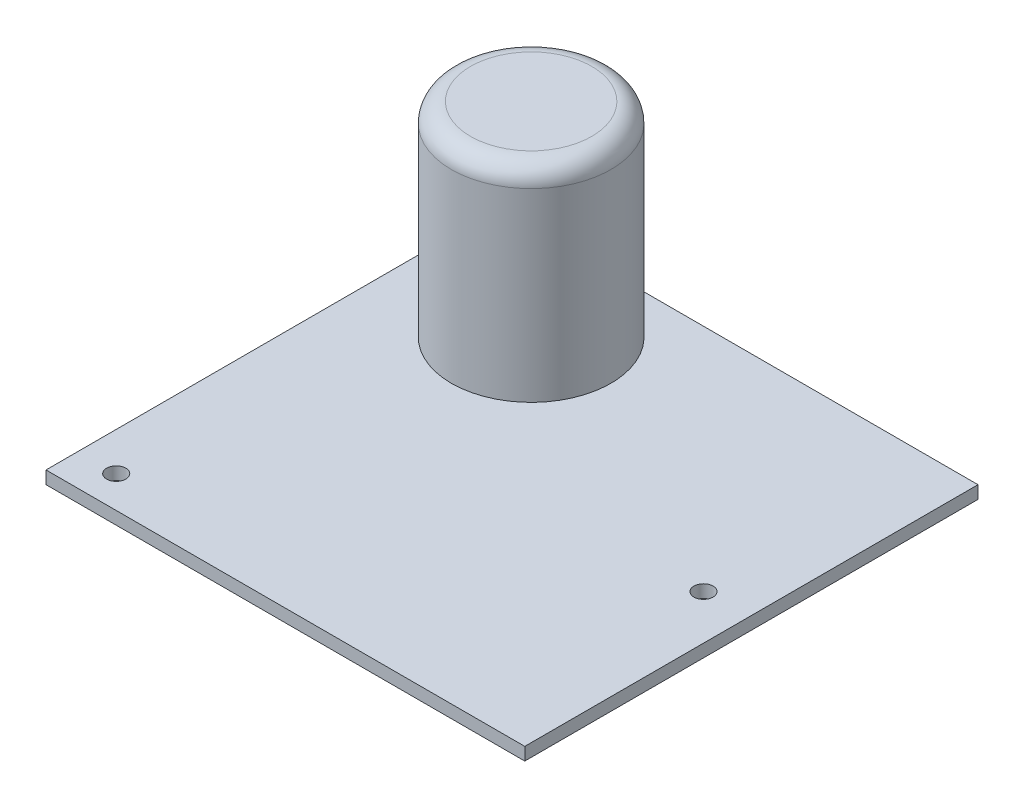
ISO-10303-21;
HEADER;
FILE_DESCRIPTION(('STEP AP214'),'2;1');
FILE_NAME('part.step','',(''),(''),'','','');
FILE_SCHEMA(('AUTOMOTIVE_DESIGN { 1 0 10303 214 1 1 1 1 }'));
ENDSEC;
DATA;
#1=APPLICATION_CONTEXT('core data for automotive mechanical design processes');
#2=APPLICATION_PROTOCOL_DEFINITION('international standard','automotive_design',2000,#1);
#3=PRODUCT_CONTEXT('',#1,'mechanical');
#4=PRODUCT('Part','Part','',(#3));
#5=PRODUCT_RELATED_PRODUCT_CATEGORY('part','',(#4));
#6=PRODUCT_DEFINITION_FORMATION('','',#4);
#7=PRODUCT_DEFINITION_CONTEXT('part definition',#1,'design');
#8=PRODUCT_DEFINITION('design','',#6,#7);
#9=PRODUCT_DEFINITION_SHAPE('','',#8);
#10=(LENGTH_UNIT() NAMED_UNIT(*) SI_UNIT(.MILLI.,.METRE.));
#11=(NAMED_UNIT(*) PLANE_ANGLE_UNIT() SI_UNIT($,.RADIAN.));
#12=(NAMED_UNIT(*) SI_UNIT($,.STERADIAN.) SOLID_ANGLE_UNIT());
#13=UNCERTAINTY_MEASURE_WITH_UNIT(LENGTH_MEASURE(1.E-05),#10,'distance_accuracy_value','');
#14=(GEOMETRIC_REPRESENTATION_CONTEXT(3) GLOBAL_UNCERTAINTY_ASSIGNED_CONTEXT((#13)) GLOBAL_UNIT_ASSIGNED_CONTEXT((#10,
#11,#12)) REPRESENTATION_CONTEXT('',''));
#15=CARTESIAN_POINT('',(0.,0.,0.));
#16=DIRECTION('',(0.,0.,1.));
#17=DIRECTION('',(1.,0.,0.));
#18=AXIS2_PLACEMENT_3D('',#15,#16,#17);
#19=CARTESIAN_POINT('',(0.,2.,0.));
#20=DIRECTION('',(0.,1.,0.));
#21=DIRECTION('',(0.,0.,1.));
#22=AXIS2_PLACEMENT_3D('',#19,#20,#21);
#23=PLANE('',#22);
#24=CARTESIAN_POINT('',(30.5,2.,0.999999999999987));
#25=DIRECTION('',(0.,1.,0.));
#26=DIRECTION('',(0.,0.,1.));
#27=AXIS2_PLACEMENT_3D('',#24,#25,#26);
#28=CIRCLE('',#27,1.5);
#29=CARTESIAN_POINT('',(30.5,2.,2.49999999999999));
#30=VERTEX_POINT('',#29);
#31=EDGE_CURVE('E159',#30,#30,#28,.T.);
#32=ORIENTED_EDGE('',*,*,#31,.F.);
#33=EDGE_LOOP('',(#32));
#34=FACE_BOUND('',#33,.T.);
#35=CARTESIAN_POINT('',(-31.5,2.,-30.));
#36=DIRECTION('',(0.,1.,0.));
#37=DIRECTION('',(0.,0.,1.));
#38=AXIS2_PLACEMENT_3D('',#35,#36,#37);
#39=CIRCLE('',#38,1.5);
#40=CARTESIAN_POINT('',(-31.5,2.,-28.5));
#41=VERTEX_POINT('',#40);
#42=EDGE_CURVE('E103',#41,#41,#39,.T.);
#43=ORIENTED_EDGE('',*,*,#42,.F.);
#44=EDGE_LOOP('',(#43));
#45=FACE_BOUND('',#44,.T.);
#46=DIRECTION('',(0.,0.,1.));
#47=VECTOR('',#46,1.);
#48=CARTESIAN_POINT('',(-37.5,2.,-35.));
#49=LINE('',#48,#47);
#50=CARTESIAN_POINT('',(-37.5,2.,-35.));
#51=VERTEX_POINT('',#50);
#52=CARTESIAN_POINT('',(-37.5,2.,36.));
#53=VERTEX_POINT('',#52);
#54=EDGE_CURVE('E85',#51,#53,#49,.T.);
#55=ORIENTED_EDGE('',*,*,#54,.T.);
#56=DIRECTION('',(1.,0.,0.));
#57=VECTOR('',#56,1.);
#58=CARTESIAN_POINT('',(-37.5,2.,36.));
#59=LINE('',#58,#57);
#60=CARTESIAN_POINT('',(37.5,2.,36.));
#61=VERTEX_POINT('',#60);
#62=EDGE_CURVE('E80',#53,#61,#59,.T.);
#63=ORIENTED_EDGE('',*,*,#62,.T.);
#64=DIRECTION('',(0.,0.,-1.));
#65=VECTOR('',#64,1.);
#66=CARTESIAN_POINT('',(37.5,2.,-35.));
#67=LINE('',#66,#65);
#68=CARTESIAN_POINT('',(37.5,2.,-35.));
#69=VERTEX_POINT('',#68);
#70=EDGE_CURVE('E83',#61,#69,#67,.T.);
#71=ORIENTED_EDGE('',*,*,#70,.T.);
#72=DIRECTION('',(-1.,0.,0.));
#73=VECTOR('',#72,1.);
#74=CARTESIAN_POINT('',(-37.5,2.,-35.));
#75=LINE('',#74,#73);
#76=EDGE_CURVE('E49',#69,#51,#75,.T.);
#77=ORIENTED_EDGE('',*,*,#76,.T.);
#78=EDGE_LOOP('',(#55,#63,#71,#77));
#79=FACE_BOUND('',#78,.T.);
#80=CARTESIAN_POINT('',(-31.5,2.,31.));
#81=DIRECTION('',(0.,1.,0.));
#82=DIRECTION('',(0.,0.,1.));
#83=AXIS2_PLACEMENT_3D('',#80,#81,#82);
#84=CIRCLE('',#83,1.5);
#85=CARTESIAN_POINT('',(-31.5,2.,32.5));
#86=VERTEX_POINT('',#85);
#87=EDGE_CURVE('E168',#86,#86,#84,.T.);
#88=ORIENTED_EDGE('',*,*,#87,.F.);
#89=EDGE_LOOP('',(#88));
#90=FACE_BOUND('',#89,.T.);
#91=CARTESIAN_POINT('',(-17.5,2.,-20.));
#92=DIRECTION('',(0.,1.,0.));
#93=DIRECTION('',(0.,0.,1.));
#94=AXIS2_PLACEMENT_3D('',#91,#92,#93);
#95=CIRCLE('',#94,12.5);
#96=CARTESIAN_POINT('',(-17.5,2.,-7.50000000000001));
#97=VERTEX_POINT('',#96);
#98=EDGE_CURVE('E160',#97,#97,#95,.T.);
#99=ORIENTED_EDGE('',*,*,#98,.F.);
#100=EDGE_LOOP('',(#99));
#101=FACE_BOUND('',#100,.T.);
#102=ADVANCED_FACE('F32',(#34,#45,#79,#90,#101),#23,.T.);
#103=CARTESIAN_POINT('',(0.,0.,0.));
#104=DIRECTION('',(0.,1.,0.));
#105=DIRECTION('',(0.,0.,1.));
#106=AXIS2_PLACEMENT_3D('',#103,#104,#105);
#107=PLANE('',#106);
#108=CARTESIAN_POINT('',(-31.5,0.,31.));
#109=DIRECTION('',(0.,1.,0.));
#110=DIRECTION('',(0.,0.,1.));
#111=AXIS2_PLACEMENT_3D('',#108,#109,#110);
#112=CIRCLE('',#111,1.5);
#113=CARTESIAN_POINT('',(-31.5,0.,32.5));
#114=VERTEX_POINT('',#113);
#115=EDGE_CURVE('E163',#114,#114,#112,.T.);
#116=ORIENTED_EDGE('',*,*,#115,.T.);
#117=EDGE_LOOP('',(#116));
#118=FACE_BOUND('',#117,.T.);
#119=DIRECTION('',(0.,0.,1.));
#120=VECTOR('',#119,1.);
#121=CARTESIAN_POINT('',(-37.5,0.,-35.));
#122=LINE('',#121,#120);
#123=CARTESIAN_POINT('',(-37.5,0.,-35.));
#124=VERTEX_POINT('',#123);
#125=CARTESIAN_POINT('',(-37.5,0.,36.));
#126=VERTEX_POINT('',#125);
#127=EDGE_CURVE('E100',#124,#126,#122,.T.);
#128=ORIENTED_EDGE('',*,*,#127,.F.);
#129=DIRECTION('',(-1.,0.,0.));
#130=VECTOR('',#129,1.);
#131=CARTESIAN_POINT('',(-37.5,0.,-35.));
#132=LINE('',#131,#130);
#133=CARTESIAN_POINT('',(37.5,0.,-35.));
#134=VERTEX_POINT('',#133);
#135=EDGE_CURVE('E72',#134,#124,#132,.T.);
#136=ORIENTED_EDGE('',*,*,#135,.F.);
#137=DIRECTION('',(0.,0.,-1.));
#138=VECTOR('',#137,1.);
#139=CARTESIAN_POINT('',(37.5,0.,-35.));
#140=LINE('',#139,#138);
#141=CARTESIAN_POINT('',(37.5,0.,36.));
#142=VERTEX_POINT('',#141);
#143=EDGE_CURVE('E66',#142,#134,#140,.T.);
#144=ORIENTED_EDGE('',*,*,#143,.F.);
#145=DIRECTION('',(1.,0.,0.));
#146=VECTOR('',#145,1.);
#147=CARTESIAN_POINT('',(-37.5,0.,36.));
#148=LINE('',#147,#146);
#149=EDGE_CURVE('E90',#126,#142,#148,.T.);
#150=ORIENTED_EDGE('',*,*,#149,.F.);
#151=EDGE_LOOP('',(#128,#136,#144,#150));
#152=FACE_BOUND('',#151,.T.);
#153=CARTESIAN_POINT('',(-31.5,0.,-30.));
#154=DIRECTION('',(0.,1.,0.));
#155=DIRECTION('',(0.,0.,1.));
#156=AXIS2_PLACEMENT_3D('',#153,#154,#155);
#157=CIRCLE('',#156,1.5);
#158=CARTESIAN_POINT('',(-31.5,0.,-28.5));
#159=VERTEX_POINT('',#158);
#160=EDGE_CURVE('E154',#159,#159,#157,.T.);
#161=ORIENTED_EDGE('',*,*,#160,.T.);
#162=EDGE_LOOP('',(#161));
#163=FACE_BOUND('',#162,.T.);
#164=CARTESIAN_POINT('',(30.5,0.,0.999999999999987));
#165=DIRECTION('',(0.,1.,0.));
#166=DIRECTION('',(0.,0.,1.));
#167=AXIS2_PLACEMENT_3D('',#164,#165,#166);
#168=CIRCLE('',#167,1.5);
#169=CARTESIAN_POINT('',(30.5,0.,2.49999999999999));
#170=VERTEX_POINT('',#169);
#171=EDGE_CURVE('E157',#170,#170,#168,.T.);
#172=ORIENTED_EDGE('',*,*,#171,.T.);
#173=EDGE_LOOP('',(#172));
#174=FACE_BOUND('',#173,.T.);
#175=ADVANCED_FACE('F123',(#118,#152,#163,#174),#107,.F.);
#176=CARTESIAN_POINT('',(-37.5,2.,-35.));
#177=DIRECTION('',(1.,0.,0.));
#178=DIRECTION('',(0.,0.,-1.));
#179=AXIS2_PLACEMENT_3D('',#176,#177,#178);
#180=PLANE('',#179);
#181=ORIENTED_EDGE('',*,*,#127,.T.);
#182=DIRECTION('',(0.,-1.,0.));
#183=VECTOR('',#182,1.);
#184=CARTESIAN_POINT('',(-37.5,2.,36.));
#185=LINE('',#184,#183);
#186=EDGE_CURVE('E91',#53,#126,#185,.T.);
#187=ORIENTED_EDGE('',*,*,#186,.F.);
#188=ORIENTED_EDGE('',*,*,#54,.F.);
#189=DIRECTION('',(0.,-1.,0.));
#190=VECTOR('',#189,1.);
#191=CARTESIAN_POINT('',(-37.5,2.,-35.));
#192=LINE('',#191,#190);
#193=EDGE_CURVE('E96',#51,#124,#192,.T.);
#194=ORIENTED_EDGE('',*,*,#193,.T.);
#195=EDGE_LOOP('',(#181,#187,#188,#194));
#196=FACE_BOUND('',#195,.T.);
#197=ADVANCED_FACE('F129',(#196),#180,.F.);
#198=CARTESIAN_POINT('',(-37.5,2.,36.));
#199=DIRECTION('',(0.,0.,-1.));
#200=DIRECTION('',(-1.,0.,0.));
#201=AXIS2_PLACEMENT_3D('',#198,#199,#200);
#202=PLANE('',#201);
#203=ORIENTED_EDGE('',*,*,#149,.T.);
#204=DIRECTION('',(0.,-1.,0.));
#205=VECTOR('',#204,1.);
#206=CARTESIAN_POINT('',(37.5,2.,36.));
#207=LINE('',#206,#205);
#208=EDGE_CURVE('E88',#61,#142,#207,.T.);
#209=ORIENTED_EDGE('',*,*,#208,.F.);
#210=ORIENTED_EDGE('',*,*,#62,.F.);
#211=ORIENTED_EDGE('',*,*,#186,.T.);
#212=EDGE_LOOP('',(#203,#209,#210,#211));
#213=FACE_BOUND('',#212,.T.);
#214=ADVANCED_FACE('F89',(#213),#202,.F.);
#215=CARTESIAN_POINT('',(37.5,2.,-35.));
#216=DIRECTION('',(-1.,0.,0.));
#217=DIRECTION('',(0.,0.,1.));
#218=AXIS2_PLACEMENT_3D('',#215,#216,#217);
#219=PLANE('',#218);
#220=ORIENTED_EDGE('',*,*,#143,.T.);
#221=DIRECTION('',(0.,-1.,0.));
#222=VECTOR('',#221,1.);
#223=CARTESIAN_POINT('',(37.5,2.,-35.));
#224=LINE('',#223,#222);
#225=EDGE_CURVE('E92',#69,#134,#224,.T.);
#226=ORIENTED_EDGE('',*,*,#225,.F.);
#227=ORIENTED_EDGE('',*,*,#70,.F.);
#228=ORIENTED_EDGE('',*,*,#208,.T.);
#229=EDGE_LOOP('',(#220,#226,#227,#228));
#230=FACE_BOUND('',#229,.T.);
#231=ADVANCED_FACE('F94',(#230),#219,.F.);
#232=CARTESIAN_POINT('',(-37.5,2.,-35.));
#233=DIRECTION('',(0.,0.,1.));
#234=DIRECTION('',(1.,0.,0.));
#235=AXIS2_PLACEMENT_3D('',#232,#233,#234);
#236=PLANE('',#235);
#237=ORIENTED_EDGE('',*,*,#135,.T.);
#238=ORIENTED_EDGE('',*,*,#193,.F.);
#239=ORIENTED_EDGE('',*,*,#76,.F.);
#240=ORIENTED_EDGE('',*,*,#225,.T.);
#241=EDGE_LOOP('',(#237,#238,#239,#240));
#242=FACE_BOUND('',#241,.T.);
#243=ADVANCED_FACE('F138',(#242),#236,.F.);
#244=CARTESIAN_POINT('',(-31.5,2.,-30.));
#245=DIRECTION('',(0.,-1.,0.));
#246=DIRECTION('',(0.,0.,-1.));
#247=AXIS2_PLACEMENT_3D('',#244,#245,#246);
#248=CYLINDRICAL_SURFACE('',#247,1.5);
#249=ORIENTED_EDGE('',*,*,#42,.T.);
#250=EDGE_LOOP('',(#249));
#251=FACE_BOUND('',#250,.T.);
#252=ORIENTED_EDGE('',*,*,#160,.F.);
#253=EDGE_LOOP('',(#252));
#254=FACE_BOUND('',#253,.T.);
#255=ADVANCED_FACE('F135',(#251,#254),#248,.F.);
#256=CARTESIAN_POINT('',(-31.5,2.,31.));
#257=DIRECTION('',(0.,-1.,0.));
#258=DIRECTION('',(0.,0.,-1.));
#259=AXIS2_PLACEMENT_3D('',#256,#257,#258);
#260=CYLINDRICAL_SURFACE('',#259,1.5);
#261=ORIENTED_EDGE('',*,*,#87,.T.);
#262=EDGE_LOOP('',(#261));
#263=FACE_BOUND('',#262,.T.);
#264=ORIENTED_EDGE('',*,*,#115,.F.);
#265=EDGE_LOOP('',(#264));
#266=FACE_BOUND('',#265,.T.);
#267=ADVANCED_FACE('F179',(#263,#266),#260,.F.);
#268=CARTESIAN_POINT('',(30.5,2.,0.999999999999987));
#269=DIRECTION('',(0.,-1.,0.));
#270=DIRECTION('',(0.,0.,-1.));
#271=AXIS2_PLACEMENT_3D('',#268,#269,#270);
#272=CYLINDRICAL_SURFACE('',#271,1.5);
#273=ORIENTED_EDGE('',*,*,#31,.T.);
#274=EDGE_LOOP('',(#273));
#275=FACE_BOUND('',#274,.T.);
#276=ORIENTED_EDGE('',*,*,#171,.F.);
#277=EDGE_LOOP('',(#276));
#278=FACE_BOUND('',#277,.T.);
#279=ADVANCED_FACE('F183',(#275,#278),#272,.F.);
#280=CARTESIAN_POINT('',(-17.5,34.,-20.));
#281=DIRECTION('',(0.,-1.,0.));
#282=DIRECTION('',(0.,0.,-1.));
#283=AXIS2_PLACEMENT_3D('',#280,#281,#282);
#284=CYLINDRICAL_SURFACE('',#283,12.5);
#285=CARTESIAN_POINT('',(-17.5,31.,-20.));
#286=DIRECTION('',(0.,1.,0.));
#287=DIRECTION('',(0.,0.,1.));
#288=AXIS2_PLACEMENT_3D('',#285,#286,#287);
#289=CIRCLE('',#288,12.5);
#290=CARTESIAN_POINT('',(-17.5,31.,-7.50000000000001));
#291=VERTEX_POINT('',#290);
#292=EDGE_CURVE('E11',#291,#291,#289,.F.);
#293=ORIENTED_EDGE('',*,*,#292,.T.);
#294=EDGE_LOOP('',(#293));
#295=FACE_BOUND('',#294,.T.);
#296=ORIENTED_EDGE('',*,*,#98,.T.);
#297=EDGE_LOOP('',(#296));
#298=FACE_BOUND('',#297,.T.);
#299=ADVANCED_FACE('F119',(#295,#298),#284,.T.);
#300=CARTESIAN_POINT('',(-17.5,34.,-20.));
#301=DIRECTION('',(0.,1.,0.));
#302=DIRECTION('',(0.,0.,1.));
#303=AXIS2_PLACEMENT_3D('',#300,#301,#302);
#304=PLANE('',#303);
#305=CARTESIAN_POINT('',(-17.5,34.,-20.));
#306=DIRECTION('',(0.,1.,0.));
#307=DIRECTION('',(0.,0.,1.));
#308=AXIS2_PLACEMENT_3D('',#305,#306,#307);
#309=CIRCLE('',#308,9.5);
#310=CARTESIAN_POINT('',(-17.5,34.,-10.5));
#311=VERTEX_POINT('',#310);
#312=EDGE_CURVE('E41',#311,#311,#309,.T.);
#313=ORIENTED_EDGE('',*,*,#312,.T.);
#314=EDGE_LOOP('',(#313));
#315=FACE_BOUND('',#314,.T.);
#316=ADVANCED_FACE('F112',(#315),#304,.T.);
#317=CARTESIAN_POINT('',(-17.5,31.,-20.));
#318=DIRECTION('',(0.,1.,0.));
#319=DIRECTION('',(0.,0.,1.));
#320=AXIS2_PLACEMENT_3D('',#317,#318,#319);
#321=TOROIDAL_SURFACE('',#320,9.5,3.);
#322=ORIENTED_EDGE('',*,*,#292,.F.);
#323=EDGE_LOOP('',(#322));
#324=FACE_BOUND('',#323,.T.);
#325=ORIENTED_EDGE('',*,*,#312,.F.);
#326=EDGE_LOOP('',(#325));
#327=FACE_BOUND('',#326,.T.);
#328=ADVANCED_FACE('F34',(#324,#327),#321,.T.);
#329=CLOSED_SHELL('',(#102,#175,#197,#214,#231,#243,#255,#267,#279,#299,#316,#328));
#330=MANIFOLD_SOLID_BREP('B2',#329);
#331=ADVANCED_BREP_SHAPE_REPRESENTATION('',(#18,#330),#14);
#332=SHAPE_DEFINITION_REPRESENTATION(#9,#331);
ENDSEC;
END-ISO-10303-21;
